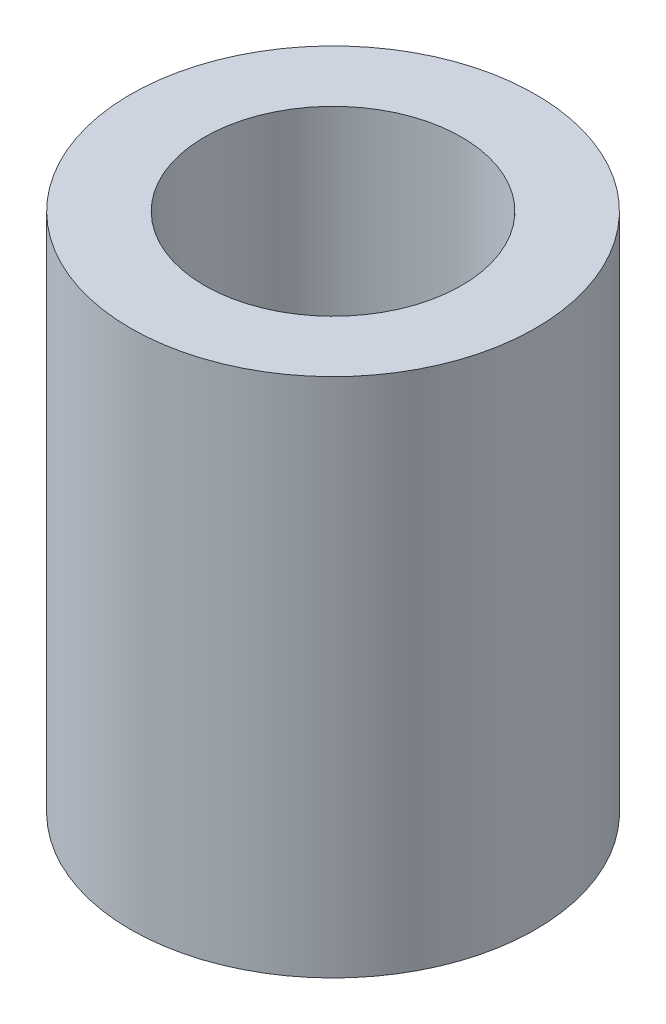
ISO-10303-21;
HEADER;
FILE_DESCRIPTION(('STEP AP214'),'2;1');
FILE_NAME('part.step','',(''),(''),'','','');
FILE_SCHEMA(('AUTOMOTIVE_DESIGN { 1 0 10303 214 1 1 1 1 }'));
ENDSEC;
DATA;
#1=APPLICATION_CONTEXT('core data for automotive mechanical design processes');
#2=APPLICATION_PROTOCOL_DEFINITION('international standard','automotive_design',2000,#1);
#3=PRODUCT_CONTEXT('',#1,'mechanical');
#4=PRODUCT('Part','Part','',(#3));
#5=PRODUCT_RELATED_PRODUCT_CATEGORY('part','',(#4));
#6=PRODUCT_DEFINITION_FORMATION('','',#4);
#7=PRODUCT_DEFINITION_CONTEXT('part definition',#1,'design');
#8=PRODUCT_DEFINITION('design','',#6,#7);
#9=PRODUCT_DEFINITION_SHAPE('','',#8);
#10=(LENGTH_UNIT() NAMED_UNIT(*) SI_UNIT(.MILLI.,.METRE.));
#11=(NAMED_UNIT(*) PLANE_ANGLE_UNIT() SI_UNIT($,.RADIAN.));
#12=(NAMED_UNIT(*) SI_UNIT($,.STERADIAN.) SOLID_ANGLE_UNIT());
#13=UNCERTAINTY_MEASURE_WITH_UNIT(LENGTH_MEASURE(1.E-05),#10,'distance_accuracy_value','');
#14=(GEOMETRIC_REPRESENTATION_CONTEXT(3) GLOBAL_UNCERTAINTY_ASSIGNED_CONTEXT((#13)) GLOBAL_UNIT_ASSIGNED_CONTEXT((#10,
#11,#12)) REPRESENTATION_CONTEXT('',''));
#15=CARTESIAN_POINT('',(0.,0.,0.));
#16=DIRECTION('',(0.,0.,1.));
#17=DIRECTION('',(1.,0.,0.));
#18=AXIS2_PLACEMENT_3D('',#15,#16,#17);
#19=CARTESIAN_POINT('',(2.,8.1,0.));
#20=DIRECTION('',(0.,1.,0.));
#21=DIRECTION('',(0.,0.,-1.));
#22=AXIS2_PLACEMENT_3D('',#19,#20,#21);
#23=PLANE('',#22);
#24=CARTESIAN_POINT('',(0.,8.1,0.));
#25=DIRECTION('',(0.,1.,0.));
#26=DIRECTION('',(0.,0.,1.));
#27=AXIS2_PLACEMENT_3D('',#24,#25,#26);
#28=CIRCLE('',#27,2.);
#29=CARTESIAN_POINT('',(0.,8.1,2.));
#30=VERTEX_POINT('',#29);
#31=EDGE_CURVE('E55',#30,#30,#28,.T.);
#32=ORIENTED_EDGE('',*,*,#31,.F.);
#33=EDGE_LOOP('',(#32));
#34=FACE_BOUND('',#33,.T.);
#35=CARTESIAN_POINT('',(0.,8.1,0.));
#36=DIRECTION('',(0.,1.,0.));
#37=DIRECTION('',(0.,0.,1.));
#38=AXIS2_PLACEMENT_3D('',#35,#36,#37);
#39=CIRCLE('',#38,3.15);
#40=CARTESIAN_POINT('',(0.,8.1,3.15));
#41=VERTEX_POINT('',#40);
#42=EDGE_CURVE('E10',#41,#41,#39,.T.);
#43=ORIENTED_EDGE('',*,*,#42,.T.);
#44=EDGE_LOOP('',(#43));
#45=FACE_BOUND('',#44,.T.);
#46=ADVANCED_FACE('F41',(#34,#45),#23,.T.);
#47=CARTESIAN_POINT('',(0.,0.,0.));
#48=DIRECTION('',(0.,-1.,0.));
#49=DIRECTION('',(0.,0.,1.));
#50=AXIS2_PLACEMENT_3D('',#47,#48,#49);
#51=CYLINDRICAL_SURFACE('',#50,3.15);
#52=ORIENTED_EDGE('',*,*,#42,.F.);
#53=EDGE_LOOP('',(#52));
#54=FACE_BOUND('',#53,.T.);
#55=CARTESIAN_POINT('',(0.,0.,0.));
#56=DIRECTION('',(0.,1.,0.));
#57=DIRECTION('',(0.,0.,1.));
#58=AXIS2_PLACEMENT_3D('',#55,#56,#57);
#59=CIRCLE('',#58,3.15);
#60=CARTESIAN_POINT('',(0.,0.,3.15));
#61=VERTEX_POINT('',#60);
#62=EDGE_CURVE('E47',#61,#61,#59,.T.);
#63=ORIENTED_EDGE('',*,*,#62,.T.);
#64=EDGE_LOOP('',(#63));
#65=FACE_BOUND('',#64,.T.);
#66=ADVANCED_FACE('F64',(#54,#65),#51,.T.);
#67=CARTESIAN_POINT('',(3.15,0.,0.));
#68=DIRECTION('',(0.,-1.,0.));
#69=DIRECTION('',(0.,0.,1.));
#70=AXIS2_PLACEMENT_3D('',#67,#68,#69);
#71=PLANE('',#70);
#72=ORIENTED_EDGE('',*,*,#62,.F.);
#73=EDGE_LOOP('',(#72));
#74=FACE_BOUND('',#73,.T.);
#75=CARTESIAN_POINT('',(0.,0.,0.));
#76=DIRECTION('',(0.,1.,0.));
#77=DIRECTION('',(0.,0.,1.));
#78=AXIS2_PLACEMENT_3D('',#75,#76,#77);
#79=CIRCLE('',#78,2.);
#80=CARTESIAN_POINT('',(0.,0.,2.));
#81=VERTEX_POINT('',#80);
#82=EDGE_CURVE('E51',#81,#81,#79,.T.);
#83=ORIENTED_EDGE('',*,*,#82,.T.);
#84=EDGE_LOOP('',(#83));
#85=FACE_BOUND('',#84,.T.);
#86=ADVANCED_FACE('F68',(#74,#85),#71,.T.);
#87=CARTESIAN_POINT('',(0.,0.,0.));
#88=DIRECTION('',(0.,-1.,0.));
#89=DIRECTION('',(0.,0.,1.));
#90=AXIS2_PLACEMENT_3D('',#87,#88,#89);
#91=CYLINDRICAL_SURFACE('',#90,2.);
#92=ORIENTED_EDGE('',*,*,#82,.F.);
#93=EDGE_LOOP('',(#92));
#94=FACE_BOUND('',#93,.T.);
#95=ORIENTED_EDGE('',*,*,#31,.T.);
#96=EDGE_LOOP('',(#95));
#97=FACE_BOUND('',#96,.T.);
#98=ADVANCED_FACE('F61',(#94,#97),#91,.F.);
#99=CLOSED_SHELL('',(#46,#66,#86,#98));
#100=MANIFOLD_SOLID_BREP('B2',#99);
#101=ADVANCED_BREP_SHAPE_REPRESENTATION('',(#18,#100),#14);
#102=SHAPE_DEFINITION_REPRESENTATION(#9,#101);
ENDSEC;
END-ISO-10303-21;
